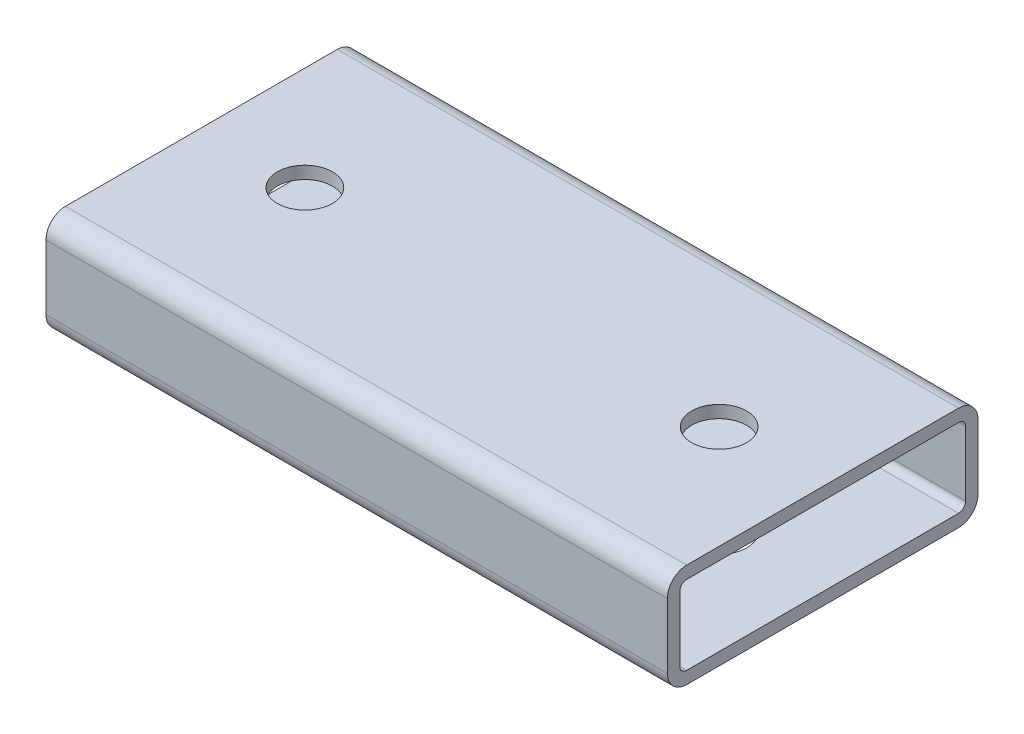
ISO-10303-21;
HEADER;
FILE_DESCRIPTION(('STEP AP214'),'2;1');
FILE_NAME('part.step','',(''),(''),'','','');
FILE_SCHEMA(('AUTOMOTIVE_DESIGN { 1 0 10303 214 1 1 1 1 }'));
ENDSEC;
DATA;
#1=APPLICATION_CONTEXT('core data for automotive mechanical design processes');
#2=APPLICATION_PROTOCOL_DEFINITION('international standard','automotive_design',2000,#1);
#3=PRODUCT_CONTEXT('',#1,'mechanical');
#4=PRODUCT('Part','Part','',(#3));
#5=PRODUCT_RELATED_PRODUCT_CATEGORY('part','',(#4));
#6=PRODUCT_DEFINITION_FORMATION('','',#4);
#7=PRODUCT_DEFINITION_CONTEXT('part definition',#1,'design');
#8=PRODUCT_DEFINITION('design','',#6,#7);
#9=PRODUCT_DEFINITION_SHAPE('','',#8);
#10=(LENGTH_UNIT() NAMED_UNIT(*) SI_UNIT(.MILLI.,.METRE.));
#11=(NAMED_UNIT(*) PLANE_ANGLE_UNIT() SI_UNIT($,.RADIAN.));
#12=(NAMED_UNIT(*) SI_UNIT($,.STERADIAN.) SOLID_ANGLE_UNIT());
#13=UNCERTAINTY_MEASURE_WITH_UNIT(LENGTH_MEASURE(1.E-05),#10,'distance_accuracy_value','');
#14=(GEOMETRIC_REPRESENTATION_CONTEXT(3) GLOBAL_UNCERTAINTY_ASSIGNED_CONTEXT((#13)) GLOBAL_UNIT_ASSIGNED_CONTEXT((#10,
#11,#12)) REPRESENTATION_CONTEXT('',''));
#15=CARTESIAN_POINT('',(0.,0.,0.));
#16=DIRECTION('',(0.,0.,1.));
#17=DIRECTION('',(1.,0.,0.));
#18=AXIS2_PLACEMENT_3D('',#15,#16,#17);
#19=CARTESIAN_POINT('',(-76.2,7.9375,33.3375));
#20=DIRECTION('',(1.,0.,0.));
#21=DIRECTION('',(0.,0.,-1.));
#22=AXIS2_PLACEMENT_3D('',#19,#20,#21);
#23=CYLINDRICAL_SURFACE('',#22,4.7625);
#24=CARTESIAN_POINT('',(76.2,7.9375,33.3375));
#25=DIRECTION('',(-1.,0.,0.));
#26=DIRECTION('',(0.,0.,1.));
#27=AXIS2_PLACEMENT_3D('',#24,#25,#26);
#28=CIRCLE('',#27,4.7625);
#29=CARTESIAN_POINT('',(76.2,7.9375,38.1));
#30=VERTEX_POINT('',#29);
#31=CARTESIAN_POINT('',(76.2,12.7,33.3375));
#32=VERTEX_POINT('',#31);
#33=EDGE_CURVE('E235',#30,#32,#28,.T.);
#34=ORIENTED_EDGE('',*,*,#33,.T.);
#35=DIRECTION('',(1.,0.,0.));
#36=VECTOR('',#35,1.);
#37=CARTESIAN_POINT('',(-76.2,12.7,33.3375));
#38=LINE('',#37,#36);
#39=CARTESIAN_POINT('',(-76.2,12.7,33.3375));
#40=VERTEX_POINT('',#39);
#41=EDGE_CURVE('E12',#40,#32,#38,.T.);
#42=ORIENTED_EDGE('',*,*,#41,.F.);
#43=CARTESIAN_POINT('',(-76.2,7.9375,33.3375));
#44=DIRECTION('',(-1.,0.,0.));
#45=DIRECTION('',(0.,0.,1.));
#46=AXIS2_PLACEMENT_3D('',#43,#44,#45);
#47=CIRCLE('',#46,4.7625);
#48=CARTESIAN_POINT('',(-76.2,7.9375,38.1));
#49=VERTEX_POINT('',#48);
#50=EDGE_CURVE('E314',#49,#40,#47,.T.);
#51=ORIENTED_EDGE('',*,*,#50,.F.);
#52=DIRECTION('',(1.,0.,0.));
#53=VECTOR('',#52,1.);
#54=CARTESIAN_POINT('',(-76.2,7.9375,38.1));
#55=LINE('',#54,#53);
#56=EDGE_CURVE('E250',#49,#30,#55,.T.);
#57=ORIENTED_EDGE('',*,*,#56,.T.);
#58=EDGE_LOOP('',(#34,#42,#51,#57));
#59=FACE_BOUND('',#58,.T.);
#60=ADVANCED_FACE('F61',(#59),#23,.T.);
#61=CARTESIAN_POINT('',(-76.2,12.7,33.3375));
#62=DIRECTION('',(0.,-1.,0.));
#63=DIRECTION('',(0.,0.,-1.));
#64=AXIS2_PLACEMENT_3D('',#61,#62,#63);
#65=PLANE('',#64);
#66=CARTESIAN_POINT('',(-50.8,12.7,0.));
#67=DIRECTION('',(0.,1.,0.));
#68=DIRECTION('',(0.,0.,1.));
#69=AXIS2_PLACEMENT_3D('',#66,#67,#68);
#70=CIRCLE('',#69,6.74623999999999);
#71=CARTESIAN_POINT('',(-50.8,12.7,6.74623999999997));
#72=VERTEX_POINT('',#71);
#73=EDGE_CURVE('E434',#72,#72,#70,.T.);
#74=ORIENTED_EDGE('',*,*,#73,.F.);
#75=EDGE_LOOP('',(#74));
#76=FACE_BOUND('',#75,.T.);
#77=CARTESIAN_POINT('',(50.8,12.7,0.));
#78=DIRECTION('',(0.,1.,0.));
#79=DIRECTION('',(0.,0.,1.));
#80=AXIS2_PLACEMENT_3D('',#77,#78,#79);
#81=CIRCLE('',#80,6.74623999999999);
#82=CARTESIAN_POINT('',(50.8,12.7,6.74623999999995));
#83=VERTEX_POINT('',#82);
#84=EDGE_CURVE('E283',#83,#83,#81,.T.);
#85=ORIENTED_EDGE('',*,*,#84,.F.);
#86=EDGE_LOOP('',(#85));
#87=FACE_BOUND('',#86,.T.);
#88=DIRECTION('',(0.,0.,-1.));
#89=VECTOR('',#88,1.);
#90=CARTESIAN_POINT('',(76.2,12.7,33.3375));
#91=LINE('',#90,#89);
#92=CARTESIAN_POINT('',(76.2,12.7,-33.3375));
#93=VERTEX_POINT('',#92);
#94=EDGE_CURVE('E238',#32,#93,#91,.T.);
#95=ORIENTED_EDGE('',*,*,#94,.T.);
#96=DIRECTION('',(1.,0.,0.));
#97=VECTOR('',#96,1.);
#98=CARTESIAN_POINT('',(-76.2,12.7,-33.3375));
#99=LINE('',#98,#97);
#100=CARTESIAN_POINT('',(-76.2,12.7,-33.3375));
#101=VERTEX_POINT('',#100);
#102=EDGE_CURVE('E71',#101,#93,#99,.T.);
#103=ORIENTED_EDGE('',*,*,#102,.F.);
#104=DIRECTION('',(0.,0.,-1.));
#105=VECTOR('',#104,1.);
#106=CARTESIAN_POINT('',(-76.2,12.7,33.3375));
#107=LINE('',#106,#105);
#108=EDGE_CURVE('E316',#40,#101,#107,.T.);
#109=ORIENTED_EDGE('',*,*,#108,.F.);
#110=ORIENTED_EDGE('',*,*,#41,.T.);
#111=EDGE_LOOP('',(#95,#103,#109,#110));
#112=FACE_BOUND('',#111,.T.);
#113=ADVANCED_FACE('F354',(#76,#87,#112),#65,.F.);
#114=CARTESIAN_POINT('',(-76.2,7.9375,-33.3375));
#115=DIRECTION('',(1.,0.,0.));
#116=DIRECTION('',(0.,0.,-1.));
#117=AXIS2_PLACEMENT_3D('',#114,#115,#116);
#118=CYLINDRICAL_SURFACE('',#117,4.7625);
#119=CARTESIAN_POINT('',(76.2,7.9375,-33.3375));
#120=DIRECTION('',(-1.,0.,0.));
#121=DIRECTION('',(0.,0.,1.));
#122=AXIS2_PLACEMENT_3D('',#119,#120,#121);
#123=CIRCLE('',#122,4.7625);
#124=CARTESIAN_POINT('',(76.2,7.9375,-38.1));
#125=VERTEX_POINT('',#124);
#126=EDGE_CURVE('E240',#93,#125,#123,.T.);
#127=ORIENTED_EDGE('',*,*,#126,.T.);
#128=DIRECTION('',(1.,0.,0.));
#129=VECTOR('',#128,1.);
#130=CARTESIAN_POINT('',(-76.2,7.9375,-38.1));
#131=LINE('',#130,#129);
#132=CARTESIAN_POINT('',(-76.2,7.9375,-38.1));
#133=VERTEX_POINT('',#132);
#134=EDGE_CURVE('E257',#133,#125,#131,.T.);
#135=ORIENTED_EDGE('',*,*,#134,.F.);
#136=CARTESIAN_POINT('',(-76.2,7.9375,-33.3375));
#137=DIRECTION('',(-1.,0.,0.));
#138=DIRECTION('',(0.,0.,1.));
#139=AXIS2_PLACEMENT_3D('',#136,#137,#138);
#140=CIRCLE('',#139,4.7625);
#141=EDGE_CURVE('E318',#101,#133,#140,.T.);
#142=ORIENTED_EDGE('',*,*,#141,.F.);
#143=ORIENTED_EDGE('',*,*,#102,.T.);
#144=EDGE_LOOP('',(#127,#135,#142,#143));
#145=FACE_BOUND('',#144,.T.);
#146=ADVANCED_FACE('F359',(#145),#118,.T.);
#147=CARTESIAN_POINT('',(-76.2,-7.9375,-38.1));
#148=DIRECTION('',(0.,0.,1.));
#149=DIRECTION('',(1.,0.,0.));
#150=AXIS2_PLACEMENT_3D('',#147,#148,#149);
#151=PLANE('',#150);
#152=DIRECTION('',(0.,-1.,0.));
#153=VECTOR('',#152,1.);
#154=CARTESIAN_POINT('',(76.2,-7.9375,-38.1));
#155=LINE('',#154,#153);
#156=CARTESIAN_POINT('',(76.2,-7.9375,-38.1));
#157=VERTEX_POINT('',#156);
#158=EDGE_CURVE('E242',#125,#157,#155,.T.);
#159=ORIENTED_EDGE('',*,*,#158,.T.);
#160=DIRECTION('',(1.,0.,0.));
#161=VECTOR('',#160,1.);
#162=CARTESIAN_POINT('',(-76.2,-7.9375,-38.1));
#163=LINE('',#162,#161);
#164=CARTESIAN_POINT('',(-76.2,-7.9375,-38.1));
#165=VERTEX_POINT('',#164);
#166=EDGE_CURVE('E254',#165,#157,#163,.T.);
#167=ORIENTED_EDGE('',*,*,#166,.F.);
#168=DIRECTION('',(0.,-1.,0.));
#169=VECTOR('',#168,1.);
#170=CARTESIAN_POINT('',(-76.2,-7.9375,-38.1));
#171=LINE('',#170,#169);
#172=EDGE_CURVE('E320',#133,#165,#171,.T.);
#173=ORIENTED_EDGE('',*,*,#172,.F.);
#174=ORIENTED_EDGE('',*,*,#134,.T.);
#175=EDGE_LOOP('',(#159,#167,#173,#174));
#176=FACE_BOUND('',#175,.T.);
#177=ADVANCED_FACE('F326',(#176),#151,.F.);
#178=CARTESIAN_POINT('',(-76.2,-7.9375,-33.3375));
#179=DIRECTION('',(1.,0.,0.));
#180=DIRECTION('',(0.,0.,-1.));
#181=AXIS2_PLACEMENT_3D('',#178,#179,#180);
#182=CYLINDRICAL_SURFACE('',#181,4.7625);
#183=CARTESIAN_POINT('',(76.2,-7.9375,-33.3375));
#184=DIRECTION('',(-1.,0.,0.));
#185=DIRECTION('',(0.,0.,1.));
#186=AXIS2_PLACEMENT_3D('',#183,#184,#185);
#187=CIRCLE('',#186,4.7625);
#188=CARTESIAN_POINT('',(76.2,-12.7,-33.3375));
#189=VERTEX_POINT('',#188);
#190=EDGE_CURVE('E244',#157,#189,#187,.T.);
#191=ORIENTED_EDGE('',*,*,#190,.T.);
#192=DIRECTION('',(1.,0.,0.));
#193=VECTOR('',#192,1.);
#194=CARTESIAN_POINT('',(-76.2,-12.7,-33.3375));
#195=LINE('',#194,#193);
#196=CARTESIAN_POINT('',(-76.2,-12.7,-33.3375));
#197=VERTEX_POINT('',#196);
#198=EDGE_CURVE('E201',#197,#189,#195,.T.);
#199=ORIENTED_EDGE('',*,*,#198,.F.);
#200=CARTESIAN_POINT('',(-76.2,-7.9375,-33.3375));
#201=DIRECTION('',(-1.,0.,0.));
#202=DIRECTION('',(0.,0.,1.));
#203=AXIS2_PLACEMENT_3D('',#200,#201,#202);
#204=CIRCLE('',#203,4.7625);
#205=EDGE_CURVE('E192',#165,#197,#204,.T.);
#206=ORIENTED_EDGE('',*,*,#205,.F.);
#207=ORIENTED_EDGE('',*,*,#166,.T.);
#208=EDGE_LOOP('',(#191,#199,#206,#207));
#209=FACE_BOUND('',#208,.T.);
#210=ADVANCED_FACE('F330',(#209),#182,.T.);
#211=CARTESIAN_POINT('',(-76.2,-12.7,-33.3375));
#212=DIRECTION('',(0.,1.,0.));
#213=DIRECTION('',(0.,0.,1.));
#214=AXIS2_PLACEMENT_3D('',#211,#212,#213);
#215=PLANE('',#214);
#216=CARTESIAN_POINT('',(-50.8,-12.7,0.));
#217=DIRECTION('',(0.,1.,0.));
#218=DIRECTION('',(0.,0.,1.));
#219=AXIS2_PLACEMENT_3D('',#216,#217,#218);
#220=CIRCLE('',#219,6.74623999999999);
#221=CARTESIAN_POINT('',(-50.8,-12.7,6.74623999999997));
#222=VERTEX_POINT('',#221);
#223=EDGE_CURVE('E432',#222,#222,#220,.T.);
#224=ORIENTED_EDGE('',*,*,#223,.T.);
#225=EDGE_LOOP('',(#224));
#226=FACE_BOUND('',#225,.T.);
#227=CARTESIAN_POINT('',(50.8,-12.7,0.));
#228=DIRECTION('',(0.,1.,0.));
#229=DIRECTION('',(0.,0.,1.));
#230=AXIS2_PLACEMENT_3D('',#227,#228,#229);
#231=CIRCLE('',#230,6.74623999999999);
#232=CARTESIAN_POINT('',(50.8,-12.7,6.74623999999995));
#233=VERTEX_POINT('',#232);
#234=EDGE_CURVE('E277',#233,#233,#231,.T.);
#235=ORIENTED_EDGE('',*,*,#234,.T.);
#236=EDGE_LOOP('',(#235));
#237=FACE_BOUND('',#236,.T.);
#238=DIRECTION('',(0.,0.,1.));
#239=VECTOR('',#238,1.);
#240=CARTESIAN_POINT('',(76.2,-12.7,-33.3375));
#241=LINE('',#240,#239);
#242=CARTESIAN_POINT('',(76.2,-12.7,33.3375));
#243=VERTEX_POINT('',#242);
#244=EDGE_CURVE('E200',#189,#243,#241,.T.);
#245=ORIENTED_EDGE('',*,*,#244,.T.);
#246=DIRECTION('',(1.,0.,0.));
#247=VECTOR('',#246,1.);
#248=CARTESIAN_POINT('',(-76.2,-12.7,33.3375));
#249=LINE('',#248,#247);
#250=CARTESIAN_POINT('',(-76.2,-12.7,33.3375));
#251=VERTEX_POINT('',#250);
#252=EDGE_CURVE('E197',#251,#243,#249,.T.);
#253=ORIENTED_EDGE('',*,*,#252,.F.);
#254=DIRECTION('',(0.,0.,1.));
#255=VECTOR('',#254,1.);
#256=CARTESIAN_POINT('',(-76.2,-12.7,-33.3375));
#257=LINE('',#256,#255);
#258=EDGE_CURVE('E186',#197,#251,#257,.T.);
#259=ORIENTED_EDGE('',*,*,#258,.F.);
#260=ORIENTED_EDGE('',*,*,#198,.T.);
#261=EDGE_LOOP('',(#245,#253,#259,#260));
#262=FACE_BOUND('',#261,.T.);
#263=ADVANCED_FACE('F198',(#226,#237,#262),#215,.F.);
#264=CARTESIAN_POINT('',(-76.2,-7.9375,33.3375));
#265=DIRECTION('',(1.,0.,0.));
#266=DIRECTION('',(0.,0.,-1.));
#267=AXIS2_PLACEMENT_3D('',#264,#265,#266);
#268=CYLINDRICAL_SURFACE('',#267,4.7625);
#269=CARTESIAN_POINT('',(76.2,-7.9375,33.3375));
#270=DIRECTION('',(-1.,0.,0.));
#271=DIRECTION('',(0.,0.,1.));
#272=AXIS2_PLACEMENT_3D('',#269,#270,#271);
#273=CIRCLE('',#272,4.7625);
#274=CARTESIAN_POINT('',(76.2,-7.9375,38.1));
#275=VERTEX_POINT('',#274);
#276=EDGE_CURVE('E133',#243,#275,#273,.T.);
#277=ORIENTED_EDGE('',*,*,#276,.T.);
#278=DIRECTION('',(1.,0.,0.));
#279=VECTOR('',#278,1.);
#280=CARTESIAN_POINT('',(-76.2,-7.9375,38.1));
#281=LINE('',#280,#279);
#282=CARTESIAN_POINT('',(-76.2,-7.9375,38.1));
#283=VERTEX_POINT('',#282);
#284=EDGE_CURVE('E202',#283,#275,#281,.T.);
#285=ORIENTED_EDGE('',*,*,#284,.F.);
#286=CARTESIAN_POINT('',(-76.2,-7.9375,33.3375));
#287=DIRECTION('',(-1.,0.,0.));
#288=DIRECTION('',(0.,0.,1.));
#289=AXIS2_PLACEMENT_3D('',#286,#287,#288);
#290=CIRCLE('',#289,4.7625);
#291=EDGE_CURVE('E190',#251,#283,#290,.T.);
#292=ORIENTED_EDGE('',*,*,#291,.F.);
#293=ORIENTED_EDGE('',*,*,#252,.T.);
#294=EDGE_LOOP('',(#277,#285,#292,#293));
#295=FACE_BOUND('',#294,.T.);
#296=ADVANCED_FACE('F204',(#295),#268,.T.);
#297=CARTESIAN_POINT('',(-76.2,7.9375,-33.3375));
#298=DIRECTION('',(1.,0.,0.));
#299=DIRECTION('',(0.,0.,-1.));
#300=AXIS2_PLACEMENT_3D('',#297,#298,#299);
#301=CYLINDRICAL_SURFACE('',#300,1.7145);
#302=CARTESIAN_POINT('',(76.2,7.9375,-33.3375));
#303=DIRECTION('',(-1.,0.,0.));
#304=DIRECTION('',(0.,0.,1.));
#305=AXIS2_PLACEMENT_3D('',#302,#303,#304);
#306=CIRCLE('',#305,1.7145);
#307=CARTESIAN_POINT('',(76.2,9.652,-33.3375));
#308=VERTEX_POINT('',#307);
#309=CARTESIAN_POINT('',(76.2,7.9375,-35.052));
#310=VERTEX_POINT('',#309);
#311=EDGE_CURVE('E210',#308,#310,#306,.T.);
#312=ORIENTED_EDGE('',*,*,#311,.F.);
#313=DIRECTION('',(1.,0.,0.));
#314=VECTOR('',#313,1.);
#315=CARTESIAN_POINT('',(-76.2,9.652,-33.3375));
#316=LINE('',#315,#314);
#317=CARTESIAN_POINT('',(-76.2,9.652,-33.3375));
#318=VERTEX_POINT('',#317);
#319=EDGE_CURVE('E147',#318,#308,#316,.T.);
#320=ORIENTED_EDGE('',*,*,#319,.F.);
#321=CARTESIAN_POINT('',(-76.2,7.9375,-33.3375));
#322=DIRECTION('',(-1.,0.,0.));
#323=DIRECTION('',(0.,0.,1.));
#324=AXIS2_PLACEMENT_3D('',#321,#322,#323);
#325=CIRCLE('',#324,1.7145);
#326=CARTESIAN_POINT('',(-76.2,7.9375,-35.052));
#327=VERTEX_POINT('',#326);
#328=EDGE_CURVE('E249',#318,#327,#325,.T.);
#329=ORIENTED_EDGE('',*,*,#328,.T.);
#330=DIRECTION('',(1.,0.,0.));
#331=VECTOR('',#330,1.);
#332=CARTESIAN_POINT('',(-76.2,7.9375,-35.052));
#333=LINE('',#332,#331);
#334=EDGE_CURVE('E206',#327,#310,#333,.T.);
#335=ORIENTED_EDGE('',*,*,#334,.T.);
#336=EDGE_LOOP('',(#312,#320,#329,#335));
#337=FACE_BOUND('',#336,.T.);
#338=ADVANCED_FACE('F63',(#337),#301,.F.);
#339=CARTESIAN_POINT('',(-76.2,9.652,33.3375));
#340=DIRECTION('',(0.,-1.,0.));
#341=DIRECTION('',(0.,0.,-1.));
#342=AXIS2_PLACEMENT_3D('',#339,#340,#341);
#343=PLANE('',#342);
#344=CARTESIAN_POINT('',(-50.8,9.652,0.));
#345=DIRECTION('',(0.,-1.,0.));
#346=DIRECTION('',(0.,0.,-1.));
#347=AXIS2_PLACEMENT_3D('',#344,#345,#346);
#348=CIRCLE('',#347,6.74623999999999);
#349=CARTESIAN_POINT('',(-50.8,9.652,-6.74624000000002));
#350=VERTEX_POINT('',#349);
#351=EDGE_CURVE('E288',#350,#350,#348,.T.);
#352=ORIENTED_EDGE('',*,*,#351,.F.);
#353=EDGE_LOOP('',(#352));
#354=FACE_BOUND('',#353,.T.);
#355=CARTESIAN_POINT('',(50.8,9.652,0.));
#356=DIRECTION('',(0.,-1.,0.));
#357=DIRECTION('',(0.,0.,-1.));
#358=AXIS2_PLACEMENT_3D('',#355,#356,#357);
#359=CIRCLE('',#358,6.74623999999999);
#360=CARTESIAN_POINT('',(50.8,9.652,-6.74624000000004));
#361=VERTEX_POINT('',#360);
#362=EDGE_CURVE('E214',#361,#361,#359,.T.);
#363=ORIENTED_EDGE('',*,*,#362,.F.);
#364=EDGE_LOOP('',(#363));
#365=FACE_BOUND('',#364,.T.);
#366=DIRECTION('',(0.,0.,-1.));
#367=VECTOR('',#366,1.);
#368=CARTESIAN_POINT('',(76.2,9.652,33.3375));
#369=LINE('',#368,#367);
#370=CARTESIAN_POINT('',(76.2,9.652,33.3375));
#371=VERTEX_POINT('',#370);
#372=EDGE_CURVE('E213',#371,#308,#369,.T.);
#373=ORIENTED_EDGE('',*,*,#372,.F.);
#374=DIRECTION('',(1.,0.,0.));
#375=VECTOR('',#374,1.);
#376=CARTESIAN_POINT('',(-76.2,9.652,33.3375));
#377=LINE('',#376,#375);
#378=CARTESIAN_POINT('',(-76.2,9.652,33.3375));
#379=VERTEX_POINT('',#378);
#380=EDGE_CURVE('E273',#379,#371,#377,.T.);
#381=ORIENTED_EDGE('',*,*,#380,.F.);
#382=DIRECTION('',(0.,0.,-1.));
#383=VECTOR('',#382,1.);
#384=CARTESIAN_POINT('',(-76.2,9.652,33.3375));
#385=LINE('',#384,#383);
#386=EDGE_CURVE('E293',#379,#318,#385,.T.);
#387=ORIENTED_EDGE('',*,*,#386,.T.);
#388=ORIENTED_EDGE('',*,*,#319,.T.);
#389=EDGE_LOOP('',(#373,#381,#387,#388));
#390=FACE_BOUND('',#389,.T.);
#391=ADVANCED_FACE('F381',(#354,#365,#390),#343,.T.);
#392=CARTESIAN_POINT('',(-76.2,7.9375,33.3375));
#393=DIRECTION('',(1.,0.,0.));
#394=DIRECTION('',(0.,0.,-1.));
#395=AXIS2_PLACEMENT_3D('',#392,#393,#394);
#396=CYLINDRICAL_SURFACE('',#395,1.7145);
#397=CARTESIAN_POINT('',(76.2,7.9375,33.3375));
#398=DIRECTION('',(-1.,0.,0.));
#399=DIRECTION('',(0.,0.,1.));
#400=AXIS2_PLACEMENT_3D('',#397,#398,#399);
#401=CIRCLE('',#400,1.7145);
#402=CARTESIAN_POINT('',(76.2,7.9375,35.052));
#403=VERTEX_POINT('',#402);
#404=EDGE_CURVE('E217',#403,#371,#401,.T.);
#405=ORIENTED_EDGE('',*,*,#404,.F.);
#406=DIRECTION('',(1.,0.,0.));
#407=VECTOR('',#406,1.);
#408=CARTESIAN_POINT('',(-76.2,7.9375,35.052));
#409=LINE('',#408,#407);
#410=CARTESIAN_POINT('',(-76.2,7.9375,35.052));
#411=VERTEX_POINT('',#410);
#412=EDGE_CURVE('E271',#411,#403,#409,.T.);
#413=ORIENTED_EDGE('',*,*,#412,.F.);
#414=CARTESIAN_POINT('',(-76.2,7.9375,33.3375));
#415=DIRECTION('',(-1.,0.,0.));
#416=DIRECTION('',(0.,0.,1.));
#417=AXIS2_PLACEMENT_3D('',#414,#415,#416);
#418=CIRCLE('',#417,1.7145);
#419=EDGE_CURVE('E296',#411,#379,#418,.T.);
#420=ORIENTED_EDGE('',*,*,#419,.T.);
#421=ORIENTED_EDGE('',*,*,#380,.T.);
#422=EDGE_LOOP('',(#405,#413,#420,#421));
#423=FACE_BOUND('',#422,.T.);
#424=ADVANCED_FACE('F378',(#423),#396,.F.);
#425=CARTESIAN_POINT('',(-76.2,7.9375,35.052));
#426=DIRECTION('',(0.,0.,-1.));
#427=DIRECTION('',(-1.,0.,0.));
#428=AXIS2_PLACEMENT_3D('',#425,#426,#427);
#429=PLANE('',#428);
#430=DIRECTION('',(0.,1.,0.));
#431=VECTOR('',#430,1.);
#432=CARTESIAN_POINT('',(76.2,7.9375,35.052));
#433=LINE('',#432,#431);
#434=CARTESIAN_POINT('',(76.2,-7.9375,35.052));
#435=VERTEX_POINT('',#434);
#436=EDGE_CURVE('E220',#435,#403,#433,.T.);
#437=ORIENTED_EDGE('',*,*,#436,.F.);
#438=DIRECTION('',(1.,0.,0.));
#439=VECTOR('',#438,1.);
#440=CARTESIAN_POINT('',(-76.2,-7.9375,35.052));
#441=LINE('',#440,#439);
#442=CARTESIAN_POINT('',(-76.2,-7.9375,35.052));
#443=VERTEX_POINT('',#442);
#444=EDGE_CURVE('E269',#443,#435,#441,.T.);
#445=ORIENTED_EDGE('',*,*,#444,.F.);
#446=DIRECTION('',(0.,1.,0.));
#447=VECTOR('',#446,1.);
#448=CARTESIAN_POINT('',(-76.2,7.9375,35.052));
#449=LINE('',#448,#447);
#450=EDGE_CURVE('E299',#443,#411,#449,.T.);
#451=ORIENTED_EDGE('',*,*,#450,.T.);
#452=ORIENTED_EDGE('',*,*,#412,.T.);
#453=EDGE_LOOP('',(#437,#445,#451,#452));
#454=FACE_BOUND('',#453,.T.);
#455=ADVANCED_FACE('F374',(#454),#429,.T.);
#456=CARTESIAN_POINT('',(-76.2,-7.9375,33.3375));
#457=DIRECTION('',(1.,0.,0.));
#458=DIRECTION('',(0.,0.,-1.));
#459=AXIS2_PLACEMENT_3D('',#456,#457,#458);
#460=CYLINDRICAL_SURFACE('',#459,1.7145);
#461=CARTESIAN_POINT('',(76.2,-7.9375,33.3375));
#462=DIRECTION('',(-1.,0.,0.));
#463=DIRECTION('',(0.,0.,1.));
#464=AXIS2_PLACEMENT_3D('',#461,#462,#463);
#465=CIRCLE('',#464,1.7145);
#466=CARTESIAN_POINT('',(76.2,-9.652,33.3375));
#467=VERTEX_POINT('',#466);
#468=EDGE_CURVE('E223',#467,#435,#465,.T.);
#469=ORIENTED_EDGE('',*,*,#468,.F.);
#470=DIRECTION('',(1.,0.,0.));
#471=VECTOR('',#470,1.);
#472=CARTESIAN_POINT('',(-76.2,-9.652,33.3375));
#473=LINE('',#472,#471);
#474=CARTESIAN_POINT('',(-76.2,-9.652,33.3375));
#475=VERTEX_POINT('',#474);
#476=EDGE_CURVE('E267',#475,#467,#473,.T.);
#477=ORIENTED_EDGE('',*,*,#476,.F.);
#478=CARTESIAN_POINT('',(-76.2,-7.9375,33.3375));
#479=DIRECTION('',(-1.,0.,0.));
#480=DIRECTION('',(0.,0.,1.));
#481=AXIS2_PLACEMENT_3D('',#478,#479,#480);
#482=CIRCLE('',#481,1.7145);
#483=EDGE_CURVE('E302',#475,#443,#482,.T.);
#484=ORIENTED_EDGE('',*,*,#483,.T.);
#485=ORIENTED_EDGE('',*,*,#444,.T.);
#486=EDGE_LOOP('',(#469,#477,#484,#485));
#487=FACE_BOUND('',#486,.T.);
#488=ADVANCED_FACE('F370',(#487),#460,.F.);
#489=CARTESIAN_POINT('',(-76.2,-9.652,-33.3375));
#490=DIRECTION('',(0.,1.,0.));
#491=DIRECTION('',(0.,0.,1.));
#492=AXIS2_PLACEMENT_3D('',#489,#490,#491);
#493=PLANE('',#492);
#494=CARTESIAN_POINT('',(-50.8,-9.652,0.));
#495=DIRECTION('',(0.,1.,0.));
#496=DIRECTION('',(0.,0.,1.));
#497=AXIS2_PLACEMENT_3D('',#494,#495,#496);
#498=CIRCLE('',#497,6.74623999999999);
#499=CARTESIAN_POINT('',(-50.8,-9.652,6.74623999999997));
#500=VERTEX_POINT('',#499);
#501=EDGE_CURVE('E65',#500,#500,#498,.T.);
#502=ORIENTED_EDGE('',*,*,#501,.F.);
#503=EDGE_LOOP('',(#502));
#504=FACE_BOUND('',#503,.T.);
#505=CARTESIAN_POINT('',(50.8,-9.652,0.));
#506=DIRECTION('',(0.,1.,0.));
#507=DIRECTION('',(0.,0.,1.));
#508=AXIS2_PLACEMENT_3D('',#505,#506,#507);
#509=CIRCLE('',#508,6.74623999999999);
#510=CARTESIAN_POINT('',(50.8,-9.652,6.74623999999995));
#511=VERTEX_POINT('',#510);
#512=EDGE_CURVE('E275',#511,#511,#509,.T.);
#513=ORIENTED_EDGE('',*,*,#512,.F.);
#514=EDGE_LOOP('',(#513));
#515=FACE_BOUND('',#514,.T.);
#516=DIRECTION('',(0.,0.,1.));
#517=VECTOR('',#516,1.);
#518=CARTESIAN_POINT('',(76.2,-9.652,-33.3375));
#519=LINE('',#518,#517);
#520=CARTESIAN_POINT('',(76.2,-9.652,-33.3375));
#521=VERTEX_POINT('',#520);
#522=EDGE_CURVE('E226',#521,#467,#519,.T.);
#523=ORIENTED_EDGE('',*,*,#522,.F.);
#524=DIRECTION('',(1.,0.,0.));
#525=VECTOR('',#524,1.);
#526=CARTESIAN_POINT('',(-76.2,-9.652,-33.3375));
#527=LINE('',#526,#525);
#528=CARTESIAN_POINT('',(-76.2,-9.652,-33.3375));
#529=VERTEX_POINT('',#528);
#530=EDGE_CURVE('E265',#529,#521,#527,.T.);
#531=ORIENTED_EDGE('',*,*,#530,.F.);
#532=DIRECTION('',(0.,0.,1.));
#533=VECTOR('',#532,1.);
#534=CARTESIAN_POINT('',(-76.2,-9.652,-33.3375));
#535=LINE('',#534,#533);
#536=EDGE_CURVE('E305',#529,#475,#535,.T.);
#537=ORIENTED_EDGE('',*,*,#536,.T.);
#538=ORIENTED_EDGE('',*,*,#476,.T.);
#539=EDGE_LOOP('',(#523,#531,#537,#538));
#540=FACE_BOUND('',#539,.T.);
#541=ADVANCED_FACE('F366',(#504,#515,#540),#493,.T.);
#542=CARTESIAN_POINT('',(-76.2,-7.9375,-33.3375));
#543=DIRECTION('',(1.,0.,0.));
#544=DIRECTION('',(0.,0.,-1.));
#545=AXIS2_PLACEMENT_3D('',#542,#543,#544);
#546=CYLINDRICAL_SURFACE('',#545,1.7145);
#547=CARTESIAN_POINT('',(76.2,-7.9375,-33.3375));
#548=DIRECTION('',(-1.,0.,0.));
#549=DIRECTION('',(0.,0.,1.));
#550=AXIS2_PLACEMENT_3D('',#547,#548,#549);
#551=CIRCLE('',#550,1.7145);
#552=CARTESIAN_POINT('',(76.2,-7.9375,-35.052));
#553=VERTEX_POINT('',#552);
#554=EDGE_CURVE('E229',#553,#521,#551,.T.);
#555=ORIENTED_EDGE('',*,*,#554,.F.);
#556=DIRECTION('',(1.,0.,0.));
#557=VECTOR('',#556,1.);
#558=CARTESIAN_POINT('',(-76.2,-7.9375,-35.052));
#559=LINE('',#558,#557);
#560=CARTESIAN_POINT('',(-76.2,-7.9375,-35.052));
#561=VERTEX_POINT('',#560);
#562=EDGE_CURVE('E263',#561,#553,#559,.T.);
#563=ORIENTED_EDGE('',*,*,#562,.F.);
#564=CARTESIAN_POINT('',(-76.2,-7.9375,-33.3375));
#565=DIRECTION('',(-1.,0.,0.));
#566=DIRECTION('',(0.,0.,1.));
#567=AXIS2_PLACEMENT_3D('',#564,#565,#566);
#568=CIRCLE('',#567,1.7145);
#569=EDGE_CURVE('E308',#561,#529,#568,.T.);
#570=ORIENTED_EDGE('',*,*,#569,.T.);
#571=ORIENTED_EDGE('',*,*,#530,.T.);
#572=EDGE_LOOP('',(#555,#563,#570,#571));
#573=FACE_BOUND('',#572,.T.);
#574=ADVANCED_FACE('F348',(#573),#546,.F.);
#575=CARTESIAN_POINT('',(-76.2,-7.9375,-35.052));
#576=DIRECTION('',(0.,0.,1.));
#577=DIRECTION('',(1.,0.,0.));
#578=AXIS2_PLACEMENT_3D('',#575,#576,#577);
#579=PLANE('',#578);
#580=DIRECTION('',(0.,-1.,0.));
#581=VECTOR('',#580,1.);
#582=CARTESIAN_POINT('',(76.2,-7.9375,-35.052));
#583=LINE('',#582,#581);
#584=EDGE_CURVE('E232',#310,#553,#583,.T.);
#585=ORIENTED_EDGE('',*,*,#584,.F.);
#586=ORIENTED_EDGE('',*,*,#334,.F.);
#587=DIRECTION('',(0.,-1.,0.));
#588=VECTOR('',#587,1.);
#589=CARTESIAN_POINT('',(-76.2,-7.9375,-35.052));
#590=LINE('',#589,#588);
#591=EDGE_CURVE('E311',#327,#561,#590,.T.);
#592=ORIENTED_EDGE('',*,*,#591,.T.);
#593=ORIENTED_EDGE('',*,*,#562,.T.);
#594=EDGE_LOOP('',(#585,#586,#592,#593));
#595=FACE_BOUND('',#594,.T.);
#596=ADVANCED_FACE('F340',(#595),#579,.T.);
#597=CARTESIAN_POINT('',(-76.2,7.9375,38.1));
#598=DIRECTION('',(0.,0.,-1.));
#599=DIRECTION('',(-1.,0.,0.));
#600=AXIS2_PLACEMENT_3D('',#597,#598,#599);
#601=PLANE('',#600);
#602=DIRECTION('',(0.,1.,0.));
#603=VECTOR('',#602,1.);
#604=CARTESIAN_POINT('',(76.2,7.9375,38.1));
#605=LINE('',#604,#603);
#606=EDGE_CURVE('E139',#275,#30,#605,.T.);
#607=ORIENTED_EDGE('',*,*,#606,.T.);
#608=ORIENTED_EDGE('',*,*,#56,.F.);
#609=DIRECTION('',(0.,1.,0.));
#610=VECTOR('',#609,1.);
#611=CARTESIAN_POINT('',(-76.2,7.9375,38.1));
#612=LINE('',#611,#610);
#613=EDGE_CURVE('E80',#283,#49,#612,.T.);
#614=ORIENTED_EDGE('',*,*,#613,.F.);
#615=ORIENTED_EDGE('',*,*,#284,.T.);
#616=EDGE_LOOP('',(#607,#608,#614,#615));
#617=FACE_BOUND('',#616,.T.);
#618=ADVANCED_FACE('F338',(#617),#601,.F.);
#619=CARTESIAN_POINT('',(-76.2,7.9375,33.3375));
#620=DIRECTION('',(-1.,0.,0.));
#621=DIRECTION('',(0.,0.,1.));
#622=AXIS2_PLACEMENT_3D('',#619,#620,#621);
#623=PLANE('',#622);
#624=ORIENTED_EDGE('',*,*,#328,.F.);
#625=ORIENTED_EDGE('',*,*,#386,.F.);
#626=ORIENTED_EDGE('',*,*,#419,.F.);
#627=ORIENTED_EDGE('',*,*,#450,.F.);
#628=ORIENTED_EDGE('',*,*,#483,.F.);
#629=ORIENTED_EDGE('',*,*,#536,.F.);
#630=ORIENTED_EDGE('',*,*,#569,.F.);
#631=ORIENTED_EDGE('',*,*,#591,.F.);
#632=EDGE_LOOP('',(#624,#625,#626,#627,#628,#629,#630,#631));
#633=FACE_BOUND('',#632,.T.);
#634=ORIENTED_EDGE('',*,*,#50,.T.);
#635=ORIENTED_EDGE('',*,*,#108,.T.);
#636=ORIENTED_EDGE('',*,*,#141,.T.);
#637=ORIENTED_EDGE('',*,*,#172,.T.);
#638=ORIENTED_EDGE('',*,*,#205,.T.);
#639=ORIENTED_EDGE('',*,*,#258,.T.);
#640=ORIENTED_EDGE('',*,*,#291,.T.);
#641=ORIENTED_EDGE('',*,*,#613,.T.);
#642=EDGE_LOOP('',(#634,#635,#636,#637,#638,#639,#640,#641));
#643=FACE_BOUND('',#642,.T.);
#644=ADVANCED_FACE('F188',(#633,#643),#623,.T.);
#645=CARTESIAN_POINT('',(76.2,7.9375,33.3375));
#646=DIRECTION('',(-1.,0.,0.));
#647=DIRECTION('',(0.,0.,1.));
#648=AXIS2_PLACEMENT_3D('',#645,#646,#647);
#649=PLANE('',#648);
#650=ORIENTED_EDGE('',*,*,#311,.T.);
#651=ORIENTED_EDGE('',*,*,#584,.T.);
#652=ORIENTED_EDGE('',*,*,#554,.T.);
#653=ORIENTED_EDGE('',*,*,#522,.T.);
#654=ORIENTED_EDGE('',*,*,#468,.T.);
#655=ORIENTED_EDGE('',*,*,#436,.T.);
#656=ORIENTED_EDGE('',*,*,#404,.T.);
#657=ORIENTED_EDGE('',*,*,#372,.T.);
#658=EDGE_LOOP('',(#650,#651,#652,#653,#654,#655,#656,#657));
#659=FACE_BOUND('',#658,.T.);
#660=ORIENTED_EDGE('',*,*,#33,.F.);
#661=ORIENTED_EDGE('',*,*,#606,.F.);
#662=ORIENTED_EDGE('',*,*,#276,.F.);
#663=ORIENTED_EDGE('',*,*,#244,.F.);
#664=ORIENTED_EDGE('',*,*,#190,.F.);
#665=ORIENTED_EDGE('',*,*,#158,.F.);
#666=ORIENTED_EDGE('',*,*,#126,.F.);
#667=ORIENTED_EDGE('',*,*,#94,.F.);
#668=EDGE_LOOP('',(#660,#661,#662,#663,#664,#665,#666,#667));
#669=FACE_BOUND('',#668,.T.);
#670=ADVANCED_FACE('F333',(#659,#669),#649,.F.);
#671=CARTESIAN_POINT('',(50.8,12.7,0.));
#672=DIRECTION('',(0.,1.,0.));
#673=DIRECTION('',(0.,0.,1.));
#674=AXIS2_PLACEMENT_3D('',#671,#672,#673);
#675=CYLINDRICAL_SURFACE('',#674,6.74623999999999);
#676=ORIENTED_EDGE('',*,*,#512,.T.);
#677=EDGE_LOOP('',(#676));
#678=FACE_BOUND('',#677,.T.);
#679=ORIENTED_EDGE('',*,*,#234,.F.);
#680=EDGE_LOOP('',(#679));
#681=FACE_BOUND('',#680,.T.);
#682=ADVANCED_FACE('F410',(#678,#681),#675,.F.);
#683=ORIENTED_EDGE('',*,*,#362,.T.);
#684=EDGE_LOOP('',(#683));
#685=FACE_BOUND('',#684,.T.);
#686=ORIENTED_EDGE('',*,*,#84,.T.);
#687=EDGE_LOOP('',(#686));
#688=FACE_BOUND('',#687,.T.);
#689=ADVANCED_FACE('F414',(#685,#688),#675,.F.);
#690=CARTESIAN_POINT('',(-50.8,12.7,0.));
#691=DIRECTION('',(0.,1.,0.));
#692=DIRECTION('',(0.,0.,1.));
#693=AXIS2_PLACEMENT_3D('',#690,#691,#692);
#694=CYLINDRICAL_SURFACE('',#693,6.74623999999999);
#695=ORIENTED_EDGE('',*,*,#501,.T.);
#696=EDGE_LOOP('',(#695));
#697=FACE_BOUND('',#696,.T.);
#698=ORIENTED_EDGE('',*,*,#223,.F.);
#699=EDGE_LOOP('',(#698));
#700=FACE_BOUND('',#699,.T.);
#701=ADVANCED_FACE('F417',(#697,#700),#694,.F.);
#702=ORIENTED_EDGE('',*,*,#351,.T.);
#703=EDGE_LOOP('',(#702));
#704=FACE_BOUND('',#703,.T.);
#705=ORIENTED_EDGE('',*,*,#73,.T.);
#706=EDGE_LOOP('',(#705));
#707=FACE_BOUND('',#706,.T.);
#708=ADVANCED_FACE('F419',(#704,#707),#694,.F.);
#709=CLOSED_SHELL('',(#60,#113,#146,#177,#210,#263,#296,#338,#391,#424,#455,#488,#541,#574,#596,
#618,#644,#670,#682,#689,#701,#708));
#710=MANIFOLD_SOLID_BREP('B2',#709);
#711=ADVANCED_BREP_SHAPE_REPRESENTATION('',(#18,#710),#14);
#712=SHAPE_DEFINITION_REPRESENTATION(#9,#711);
ENDSEC;
END-ISO-10303-21;
